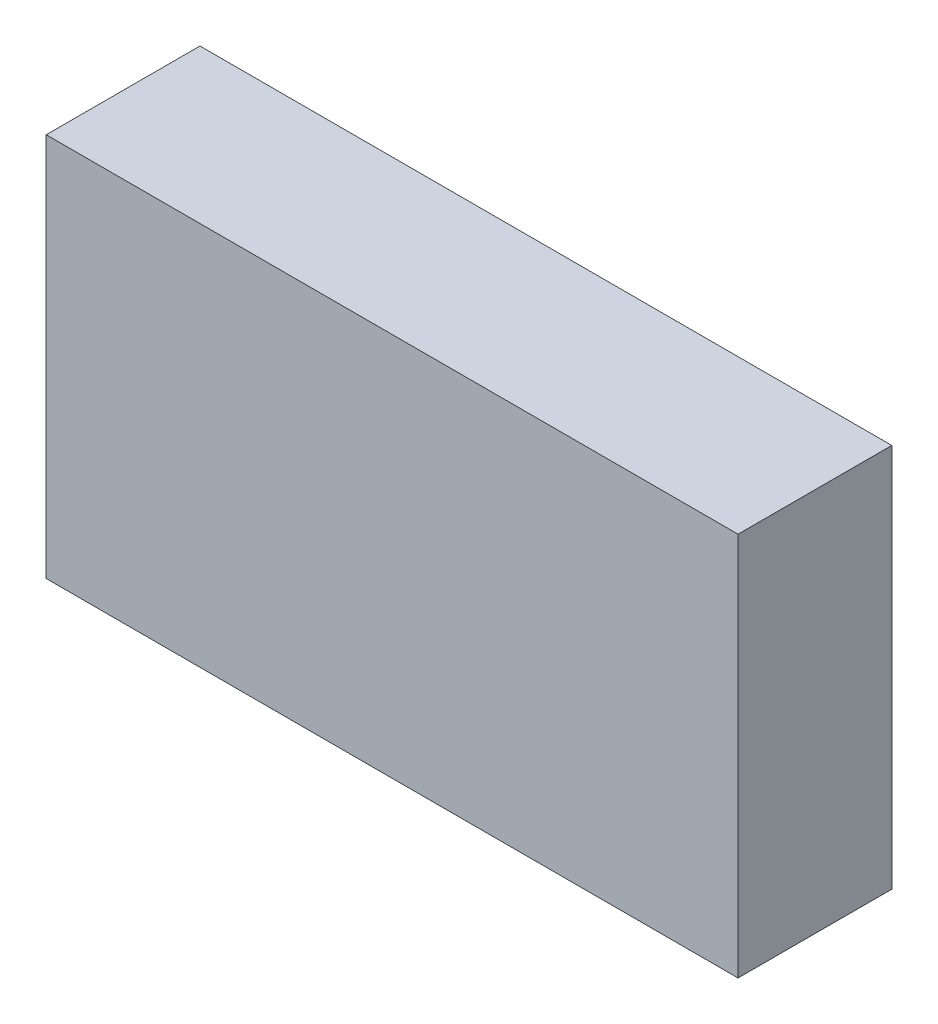
ISO-10303-21;
HEADER;
FILE_DESCRIPTION(('STEP AP214'),'2;1');
FILE_NAME('part.step','',(''),(''),'','','');
FILE_SCHEMA(('AUTOMOTIVE_DESIGN { 1 0 10303 214 1 1 1 1 }'));
ENDSEC;
DATA;
#1=APPLICATION_CONTEXT('core data for automotive mechanical design processes');
#2=APPLICATION_PROTOCOL_DEFINITION('international standard','automotive_design',2000,#1);
#3=PRODUCT_CONTEXT('',#1,'mechanical');
#4=PRODUCT('Part','Part','',(#3));
#5=PRODUCT_RELATED_PRODUCT_CATEGORY('part','',(#4));
#6=PRODUCT_DEFINITION_FORMATION('','',#4);
#7=PRODUCT_DEFINITION_CONTEXT('part definition',#1,'design');
#8=PRODUCT_DEFINITION('design','',#6,#7);
#9=PRODUCT_DEFINITION_SHAPE('','',#8);
#10=(LENGTH_UNIT() NAMED_UNIT(*) SI_UNIT(.MILLI.,.METRE.));
#11=(NAMED_UNIT(*) PLANE_ANGLE_UNIT() SI_UNIT($,.RADIAN.));
#12=(NAMED_UNIT(*) SI_UNIT($,.STERADIAN.) SOLID_ANGLE_UNIT());
#13=UNCERTAINTY_MEASURE_WITH_UNIT(LENGTH_MEASURE(1.E-05),#10,'distance_accuracy_value','');
#14=(GEOMETRIC_REPRESENTATION_CONTEXT(3) GLOBAL_UNCERTAINTY_ASSIGNED_CONTEXT((#13)) GLOBAL_UNIT_ASSIGNED_CONTEXT((#10,
#11,#12)) REPRESENTATION_CONTEXT('',''));
#15=CARTESIAN_POINT('',(0.,0.,0.));
#16=DIRECTION('',(0.,0.,1.));
#17=DIRECTION('',(1.,0.,0.));
#18=AXIS2_PLACEMENT_3D('',#15,#16,#17);
#19=CARTESIAN_POINT('',(1.6,-0.125,0.));
#20=DIRECTION('',(1.,0.,0.));
#21=DIRECTION('',(0.,0.,1.));
#22=AXIS2_PLACEMENT_3D('',#19,#20,#21);
#23=PLANE('',#22);
#24=DIRECTION('',(0.,1.,0.));
#25=VECTOR('',#24,1.);
#26=CARTESIAN_POINT('',(1.6,-0.125,0.1));
#27=LINE('',#26,#25);
#28=CARTESIAN_POINT('',(1.6,-0.125,0.1));
#29=VERTEX_POINT('',#28);
#30=CARTESIAN_POINT('',(1.6,0.125,0.1));
#31=VERTEX_POINT('',#30);
#32=EDGE_CURVE('E11',#29,#31,#27,.T.);
#33=ORIENTED_EDGE('',*,*,#32,.T.);
#34=DIRECTION('',(0.,0.,1.));
#35=VECTOR('',#34,1.);
#36=CARTESIAN_POINT('',(1.6,0.125,0.));
#37=LINE('',#36,#35);
#38=CARTESIAN_POINT('',(1.6,0.125,0.));
#39=VERTEX_POINT('',#38);
#40=EDGE_CURVE('E24',#39,#31,#37,.T.);
#41=ORIENTED_EDGE('',*,*,#40,.F.);
#42=DIRECTION('',(0.,1.,0.));
#43=VECTOR('',#42,1.);
#44=CARTESIAN_POINT('',(1.6,-0.125,0.));
#45=LINE('',#44,#43);
#46=CARTESIAN_POINT('',(1.6,-0.125,0.));
#47=VERTEX_POINT('',#46);
#48=EDGE_CURVE('E86',#47,#39,#45,.T.);
#49=ORIENTED_EDGE('',*,*,#48,.F.);
#50=DIRECTION('',(0.,0.,1.));
#51=VECTOR('',#50,1.);
#52=CARTESIAN_POINT('',(1.6,-0.125,0.));
#53=LINE('',#52,#51);
#54=EDGE_CURVE('E36',#47,#29,#53,.T.);
#55=ORIENTED_EDGE('',*,*,#54,.T.);
#56=EDGE_LOOP('',(#33,#41,#49,#55));
#57=FACE_BOUND('',#56,.T.);
#58=ADVANCED_FACE('F17',(#57),#23,.F.);
#59=CARTESIAN_POINT('',(2.05,-0.125,0.));
#60=DIRECTION('',(1.,0.,0.));
#61=DIRECTION('',(0.,0.,1.));
#62=AXIS2_PLACEMENT_3D('',#59,#60,#61);
#63=PLANE('',#62);
#64=DIRECTION('',(0.,0.,1.));
#65=VECTOR('',#64,1.);
#66=CARTESIAN_POINT('',(2.05,-0.125,0.));
#67=LINE('',#66,#65);
#68=CARTESIAN_POINT('',(2.05,-0.125,0.));
#69=VERTEX_POINT('',#68);
#70=CARTESIAN_POINT('',(2.05,-0.125,0.1));
#71=VERTEX_POINT('',#70);
#72=EDGE_CURVE('E83',#69,#71,#67,.T.);
#73=ORIENTED_EDGE('',*,*,#72,.F.);
#74=DIRECTION('',(0.,1.,0.));
#75=VECTOR('',#74,1.);
#76=CARTESIAN_POINT('',(2.05,-0.125,0.));
#77=LINE('',#76,#75);
#78=CARTESIAN_POINT('',(2.05,0.125,0.));
#79=VERTEX_POINT('',#78);
#80=EDGE_CURVE('E63',#69,#79,#77,.T.);
#81=ORIENTED_EDGE('',*,*,#80,.T.);
#82=DIRECTION('',(0.,0.,1.));
#83=VECTOR('',#82,1.);
#84=CARTESIAN_POINT('',(2.05,0.125,0.));
#85=LINE('',#84,#83);
#86=CARTESIAN_POINT('',(2.05,0.125,0.1));
#87=VERTEX_POINT('',#86);
#88=EDGE_CURVE('E57',#79,#87,#85,.T.);
#89=ORIENTED_EDGE('',*,*,#88,.T.);
#90=DIRECTION('',(0.,1.,0.));
#91=VECTOR('',#90,1.);
#92=CARTESIAN_POINT('',(2.05,-0.125,0.1));
#93=LINE('',#92,#91);
#94=EDGE_CURVE('E60',#71,#87,#93,.T.);
#95=ORIENTED_EDGE('',*,*,#94,.F.);
#96=EDGE_LOOP('',(#73,#81,#89,#95));
#97=FACE_BOUND('',#96,.T.);
#98=ADVANCED_FACE('F59',(#97),#63,.T.);
#99=CARTESIAN_POINT('',(1.6,-0.125,0.));
#100=DIRECTION('',(0.,1.,0.));
#101=DIRECTION('',(0.,0.,1.));
#102=AXIS2_PLACEMENT_3D('',#99,#100,#101);
#103=PLANE('',#102);
#104=ORIENTED_EDGE('',*,*,#72,.T.);
#105=DIRECTION('',(1.,0.,0.));
#106=VECTOR('',#105,1.);
#107=CARTESIAN_POINT('',(1.6,-0.125,0.1));
#108=LINE('',#107,#106);
#109=EDGE_CURVE('E71',#29,#71,#108,.T.);
#110=ORIENTED_EDGE('',*,*,#109,.F.);
#111=ORIENTED_EDGE('',*,*,#54,.F.);
#112=DIRECTION('',(1.,0.,0.));
#113=VECTOR('',#112,1.);
#114=CARTESIAN_POINT('',(1.6,-0.125,0.));
#115=LINE('',#114,#113);
#116=EDGE_CURVE('E76',#47,#69,#115,.T.);
#117=ORIENTED_EDGE('',*,*,#116,.T.);
#118=EDGE_LOOP('',(#104,#110,#111,#117));
#119=FACE_BOUND('',#118,.T.);
#120=ADVANCED_FACE('F91',(#119),#103,.F.);
#121=CARTESIAN_POINT('',(1.6,0.125,0.));
#122=DIRECTION('',(0.,1.,0.));
#123=DIRECTION('',(0.,0.,1.));
#124=AXIS2_PLACEMENT_3D('',#121,#122,#123);
#125=PLANE('',#124);
#126=DIRECTION('',(1.,0.,0.));
#127=VECTOR('',#126,1.);
#128=CARTESIAN_POINT('',(1.6,0.125,0.));
#129=LINE('',#128,#127);
#130=EDGE_CURVE('E74',#39,#79,#129,.T.);
#131=ORIENTED_EDGE('',*,*,#130,.F.);
#132=ORIENTED_EDGE('',*,*,#40,.T.);
#133=DIRECTION('',(1.,0.,0.));
#134=VECTOR('',#133,1.);
#135=CARTESIAN_POINT('',(1.6,0.125,0.1));
#136=LINE('',#135,#134);
#137=EDGE_CURVE('E69',#31,#87,#136,.T.);
#138=ORIENTED_EDGE('',*,*,#137,.T.);
#139=ORIENTED_EDGE('',*,*,#88,.F.);
#140=EDGE_LOOP('',(#131,#132,#138,#139));
#141=FACE_BOUND('',#140,.T.);
#142=ADVANCED_FACE('F73',(#141),#125,.T.);
#143=CARTESIAN_POINT('',(1.6,-0.125,0.));
#144=DIRECTION('',(0.,0.,1.));
#145=DIRECTION('',(1.,0.,0.));
#146=AXIS2_PLACEMENT_3D('',#143,#144,#145);
#147=PLANE('',#146);
#148=ORIENTED_EDGE('',*,*,#130,.T.);
#149=ORIENTED_EDGE('',*,*,#80,.F.);
#150=ORIENTED_EDGE('',*,*,#116,.F.);
#151=ORIENTED_EDGE('',*,*,#48,.T.);
#152=EDGE_LOOP('',(#148,#149,#150,#151));
#153=FACE_BOUND('',#152,.T.);
#154=ADVANCED_FACE('F89',(#153),#147,.F.);
#155=CARTESIAN_POINT('',(1.6,-0.125,0.1));
#156=DIRECTION('',(0.,0.,1.));
#157=DIRECTION('',(1.,0.,0.));
#158=AXIS2_PLACEMENT_3D('',#155,#156,#157);
#159=PLANE('',#158);
#160=ORIENTED_EDGE('',*,*,#32,.F.);
#161=ORIENTED_EDGE('',*,*,#109,.T.);
#162=ORIENTED_EDGE('',*,*,#94,.T.);
#163=ORIENTED_EDGE('',*,*,#137,.F.);
#164=EDGE_LOOP('',(#160,#161,#162,#163));
#165=FACE_BOUND('',#164,.T.);
#166=ADVANCED_FACE('F68',(#165),#159,.T.);
#167=CLOSED_SHELL('',(#58,#98,#120,#142,#154,#166));
#168=MANIFOLD_SOLID_BREP('B1',#167);
#169=ADVANCED_BREP_SHAPE_REPRESENTATION('',(#18,#168),#14);
#170=SHAPE_DEFINITION_REPRESENTATION(#9,#169);
ENDSEC;
END-ISO-10303-21;
